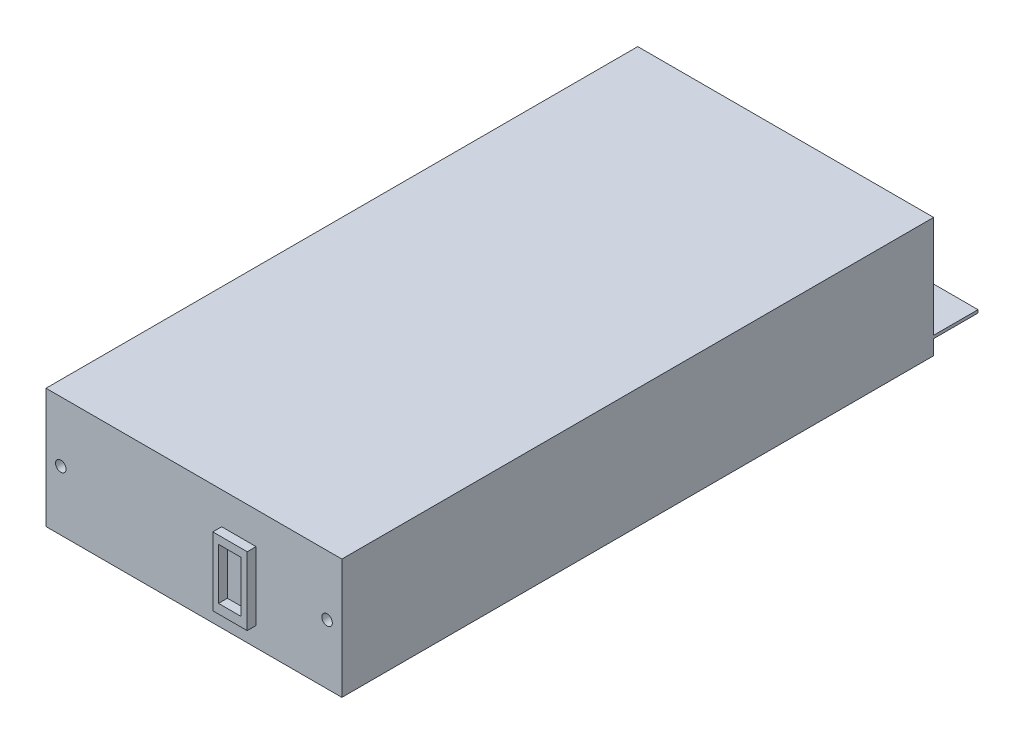
ISO-10303-21;
HEADER;
FILE_DESCRIPTION(('STEP AP214'),'2;1');
FILE_NAME('part.step','',(''),(''),'','','');
FILE_SCHEMA(('AUTOMOTIVE_DESIGN { 1 0 10303 214 1 1 1 1 }'));
ENDSEC;
DATA;
#1=APPLICATION_CONTEXT('core data for automotive mechanical design processes');
#2=APPLICATION_PROTOCOL_DEFINITION('international standard','automotive_design',2000,#1);
#3=PRODUCT_CONTEXT('',#1,'mechanical');
#4=PRODUCT('Part','Part','',(#3));
#5=PRODUCT_RELATED_PRODUCT_CATEGORY('part','',(#4));
#6=PRODUCT_DEFINITION_FORMATION('','',#4);
#7=PRODUCT_DEFINITION_CONTEXT('part definition',#1,'design');
#8=PRODUCT_DEFINITION('design','',#6,#7);
#9=PRODUCT_DEFINITION_SHAPE('','',#8);
#10=(LENGTH_UNIT() NAMED_UNIT(*) SI_UNIT(.MILLI.,.METRE.));
#11=(NAMED_UNIT(*) PLANE_ANGLE_UNIT() SI_UNIT($,.RADIAN.));
#12=(NAMED_UNIT(*) SI_UNIT($,.STERADIAN.) SOLID_ANGLE_UNIT());
#13=UNCERTAINTY_MEASURE_WITH_UNIT(LENGTH_MEASURE(1.E-05),#10,'distance_accuracy_value','');
#14=(GEOMETRIC_REPRESENTATION_CONTEXT(3) GLOBAL_UNCERTAINTY_ASSIGNED_CONTEXT((#13)) GLOBAL_UNIT_ASSIGNED_CONTEXT((#10,
#11,#12)) REPRESENTATION_CONTEXT('',''));
#15=CARTESIAN_POINT('',(0.,0.,0.));
#16=DIRECTION('',(0.,0.,1.));
#17=DIRECTION('',(1.,0.,0.));
#18=AXIS2_PLACEMENT_3D('',#15,#16,#17);
#19=CARTESIAN_POINT('',(0.,-40.5,200.));
#20=DIRECTION('',(0.,0.,1.));
#21=DIRECTION('',(1.,0.,0.));
#22=AXIS2_PLACEMENT_3D('',#19,#20,#21);
#23=PLANE('',#22);
#24=DIRECTION('',(0.,-1.,0.));
#25=VECTOR('',#24,1.);
#26=CARTESIAN_POINT('',(0.,0.,200.));
#27=LINE('',#26,#25);
#28=CARTESIAN_POINT('',(0.,0.,200.));
#29=VERTEX_POINT('',#28);
#30=CARTESIAN_POINT('',(0.,-40.5,200.));
#31=VERTEX_POINT('',#30);
#32=EDGE_CURVE('E320',#29,#31,#27,.T.);
#33=ORIENTED_EDGE('',*,*,#32,.T.);
#34=DIRECTION('',(1.,0.,0.));
#35=VECTOR('',#34,1.);
#36=CARTESIAN_POINT('',(0.,-40.5,200.));
#37=LINE('',#36,#35);
#38=CARTESIAN_POINT('',(100.,-40.5,200.));
#39=VERTEX_POINT('',#38);
#40=EDGE_CURVE('E330',#31,#39,#37,.T.);
#41=ORIENTED_EDGE('',*,*,#40,.T.);
#42=DIRECTION('',(0.,1.,0.));
#43=VECTOR('',#42,1.);
#44=CARTESIAN_POINT('',(100.,0.,200.));
#45=LINE('',#44,#43);
#46=CARTESIAN_POINT('',(100.,0.,200.));
#47=VERTEX_POINT('',#46);
#48=EDGE_CURVE('E316',#39,#47,#45,.T.);
#49=ORIENTED_EDGE('',*,*,#48,.T.);
#50=DIRECTION('',(-1.,0.,0.));
#51=VECTOR('',#50,1.);
#52=CARTESIAN_POINT('',(0.,0.,200.));
#53=LINE('',#52,#51);
#54=EDGE_CURVE('E333',#47,#29,#53,.T.);
#55=ORIENTED_EDGE('',*,*,#54,.T.);
#56=EDGE_LOOP('',(#33,#41,#49,#55));
#57=FACE_BOUND('',#56,.T.);
#58=CARTESIAN_POINT('',(95.,-20.3,200.));
#59=DIRECTION('',(0.,0.,1.));
#60=DIRECTION('',(1.,0.,0.));
#61=AXIS2_PLACEMENT_3D('',#58,#59,#60);
#62=CIRCLE('',#61,1.77800000000001);
#63=CARTESIAN_POINT('',(96.778,-20.3,200.));
#64=VERTEX_POINT('',#63);
#65=EDGE_CURVE('E346',#64,#64,#62,.T.);
#66=ORIENTED_EDGE('',*,*,#65,.F.);
#67=EDGE_LOOP('',(#66));
#68=FACE_BOUND('',#67,.T.);
#69=CARTESIAN_POINT('',(5.,-20.3,200.));
#70=DIRECTION('',(0.,0.,1.));
#71=DIRECTION('',(1.,0.,0.));
#72=AXIS2_PLACEMENT_3D('',#69,#70,#71);
#73=CIRCLE('',#72,1.778);
#74=CARTESIAN_POINT('',(6.778,-20.3,200.));
#75=VERTEX_POINT('',#74);
#76=EDGE_CURVE('E236',#75,#75,#73,.T.);
#77=ORIENTED_EDGE('',*,*,#76,.F.);
#78=EDGE_LOOP('',(#77));
#79=FACE_BOUND('',#78,.T.);
#80=DIRECTION('',(-1.,0.,0.));
#81=VECTOR('',#80,1.);
#82=CARTESIAN_POINT('',(71.0034523524499,-10.8555319811217,200.));
#83=LINE('',#82,#81);
#84=CARTESIAN_POINT('',(71.0034523524499,-10.8555319811217,200.));
#85=VERTEX_POINT('',#84);
#86=CARTESIAN_POINT('',(59.3741551003717,-10.8555319811217,200.));
#87=VERTEX_POINT('',#86);
#88=EDGE_CURVE('E183',#85,#87,#83,.T.);
#89=ORIENTED_EDGE('',*,*,#88,.F.);
#90=DIRECTION('',(0.,1.,0.));
#91=VECTOR('',#90,1.);
#92=CARTESIAN_POINT('',(71.0034523524499,-10.8555319811217,200.));
#93=LINE('',#92,#91);
#94=CARTESIAN_POINT('',(71.0034523524499,-33.9529620823669,200.));
#95=VERTEX_POINT('',#94);
#96=EDGE_CURVE('E178',#95,#85,#93,.T.);
#97=ORIENTED_EDGE('',*,*,#96,.F.);
#98=DIRECTION('',(1.,0.,0.));
#99=VECTOR('',#98,1.);
#100=CARTESIAN_POINT('',(71.0034523524499,-33.9529620823669,200.));
#101=LINE('',#100,#99);
#102=CARTESIAN_POINT('',(59.3741551003717,-33.9529620823669,200.));
#103=VERTEX_POINT('',#102);
#104=EDGE_CURVE('E187',#103,#95,#101,.T.);
#105=ORIENTED_EDGE('',*,*,#104,.F.);
#106=DIRECTION('',(0.,-1.,0.));
#107=VECTOR('',#106,1.);
#108=CARTESIAN_POINT('',(59.3741551003717,-10.8555319811217,200.));
#109=LINE('',#108,#107);
#110=EDGE_CURVE('E185',#87,#103,#109,.T.);
#111=ORIENTED_EDGE('',*,*,#110,.F.);
#112=EDGE_LOOP('',(#89,#97,#105,#111));
#113=FACE_BOUND('',#112,.T.);
#114=ADVANCED_FACE('F24',(#57,#68,#79,#113),#23,.T.);
#115=CARTESIAN_POINT('',(0.,-40.5,0.));
#116=DIRECTION('',(0.,0.,1.));
#117=DIRECTION('',(1.,0.,0.));
#118=AXIS2_PLACEMENT_3D('',#115,#116,#117);
#119=PLANE('',#118);
#120=DIRECTION('',(-1.,0.,0.));
#121=VECTOR('',#120,1.);
#122=CARTESIAN_POINT('',(0.,-35.5,0.));
#123=LINE('',#122,#121);
#124=CARTESIAN_POINT('',(100.,-35.5,0.));
#125=VERTEX_POINT('',#124);
#126=CARTESIAN_POINT('',(0.,-35.5,0.));
#127=VERTEX_POINT('',#126);
#128=EDGE_CURVE('E223',#125,#127,#123,.T.);
#129=ORIENTED_EDGE('',*,*,#128,.F.);
#130=DIRECTION('',(0.,1.,0.));
#131=VECTOR('',#130,1.);
#132=CARTESIAN_POINT('',(100.,0.,0.));
#133=LINE('',#132,#131);
#134=CARTESIAN_POINT('',(100.,-40.5,0.));
#135=VERTEX_POINT('',#134);
#136=EDGE_CURVE('E314',#135,#125,#133,.T.);
#137=ORIENTED_EDGE('',*,*,#136,.F.);
#138=DIRECTION('',(1.,0.,0.));
#139=VECTOR('',#138,1.);
#140=CARTESIAN_POINT('',(0.,-40.5,0.));
#141=LINE('',#140,#139);
#142=CARTESIAN_POINT('',(0.,-40.5,0.));
#143=VERTEX_POINT('',#142);
#144=EDGE_CURVE('E305',#143,#135,#141,.T.);
#145=ORIENTED_EDGE('',*,*,#144,.F.);
#146=DIRECTION('',(0.,-1.,0.));
#147=VECTOR('',#146,1.);
#148=CARTESIAN_POINT('',(0.,0.,0.));
#149=LINE('',#148,#147);
#150=EDGE_CURVE('E323',#127,#143,#149,.T.);
#151=ORIENTED_EDGE('',*,*,#150,.F.);
#152=EDGE_LOOP('',(#129,#137,#145,#151));
#153=FACE_BOUND('',#152,.T.);
#154=ADVANCED_FACE('F274',(#153),#119,.F.);
#155=DIRECTION('',(1.,0.,0.));
#156=VECTOR('',#155,1.);
#157=CARTESIAN_POINT('',(0.,-34.5,0.));
#158=LINE('',#157,#156);
#159=CARTESIAN_POINT('',(0.,-34.5,0.));
#160=VERTEX_POINT('',#159);
#161=CARTESIAN_POINT('',(100.,-34.5,0.));
#162=VERTEX_POINT('',#161);
#163=EDGE_CURVE('E219',#160,#162,#158,.T.);
#164=ORIENTED_EDGE('',*,*,#163,.F.);
#165=CARTESIAN_POINT('',(0.,0.,0.));
#166=VERTEX_POINT('',#165);
#167=EDGE_CURVE('E310',#166,#160,#149,.T.);
#168=ORIENTED_EDGE('',*,*,#167,.F.);
#169=DIRECTION('',(-1.,0.,0.));
#170=VECTOR('',#169,1.);
#171=CARTESIAN_POINT('',(0.,0.,0.));
#172=LINE('',#171,#170);
#173=CARTESIAN_POINT('',(100.,0.,0.));
#174=VERTEX_POINT('',#173);
#175=EDGE_CURVE('E319',#174,#166,#172,.T.);
#176=ORIENTED_EDGE('',*,*,#175,.F.);
#177=EDGE_CURVE('E224',#162,#174,#133,.T.);
#178=ORIENTED_EDGE('',*,*,#177,.F.);
#179=EDGE_LOOP('',(#164,#168,#176,#178));
#180=FACE_BOUND('',#179,.T.);
#181=ADVANCED_FACE('F281',(#180),#119,.F.);
#182=CARTESIAN_POINT('',(0.,0.,200.));
#183=DIRECTION('',(1.,0.,0.));
#184=DIRECTION('',(0.,1.,0.));
#185=AXIS2_PLACEMENT_3D('',#182,#183,#184);
#186=PLANE('',#185);
#187=ORIENTED_EDGE('',*,*,#167,.T.);
#188=DIRECTION('',(0.,0.,1.));
#189=VECTOR('',#188,1.);
#190=CARTESIAN_POINT('',(0.,-34.5,-15.));
#191=LINE('',#190,#189);
#192=CARTESIAN_POINT('',(0.,-34.5,-15.));
#193=VERTEX_POINT('',#192);
#194=EDGE_CURVE('E230',#193,#160,#191,.T.);
#195=ORIENTED_EDGE('',*,*,#194,.F.);
#196=DIRECTION('',(0.,1.,0.));
#197=VECTOR('',#196,1.);
#198=CARTESIAN_POINT('',(0.,-35.5,-15.));
#199=LINE('',#198,#197);
#200=CARTESIAN_POINT('',(0.,-35.5,-15.));
#201=VERTEX_POINT('',#200);
#202=EDGE_CURVE('E241',#201,#193,#199,.T.);
#203=ORIENTED_EDGE('',*,*,#202,.F.);
#204=DIRECTION('',(0.,0.,1.));
#205=VECTOR('',#204,1.);
#206=CARTESIAN_POINT('',(0.,-35.5,-15.));
#207=LINE('',#206,#205);
#208=EDGE_CURVE('E242',#201,#127,#207,.T.);
#209=ORIENTED_EDGE('',*,*,#208,.T.);
#210=ORIENTED_EDGE('',*,*,#150,.T.);
#211=DIRECTION('',(0.,0.,-1.));
#212=VECTOR('',#211,1.);
#213=CARTESIAN_POINT('',(0.,-40.5,200.));
#214=LINE('',#213,#212);
#215=EDGE_CURVE('E11',#31,#143,#214,.T.);
#216=ORIENTED_EDGE('',*,*,#215,.F.);
#217=ORIENTED_EDGE('',*,*,#32,.F.);
#218=DIRECTION('',(0.,0.,-1.));
#219=VECTOR('',#218,1.);
#220=CARTESIAN_POINT('',(0.,0.,200.));
#221=LINE('',#220,#219);
#222=EDGE_CURVE('E335',#29,#166,#221,.T.);
#223=ORIENTED_EDGE('',*,*,#222,.T.);
#224=EDGE_LOOP('',(#187,#195,#203,#209,#210,#216,#217,#223));
#225=FACE_BOUND('',#224,.T.);
#226=ADVANCED_FACE('F26',(#225),#186,.F.);
#227=CARTESIAN_POINT('',(0.,-40.5,200.));
#228=DIRECTION('',(0.,1.,0.));
#229=DIRECTION('',(0.,0.,1.));
#230=AXIS2_PLACEMENT_3D('',#227,#228,#229);
#231=PLANE('',#230);
#232=ORIENTED_EDGE('',*,*,#144,.T.);
#233=DIRECTION('',(0.,0.,-1.));
#234=VECTOR('',#233,1.);
#235=CARTESIAN_POINT('',(100.,-40.5,200.));
#236=LINE('',#235,#234);
#237=EDGE_CURVE('E33',#39,#135,#236,.T.);
#238=ORIENTED_EDGE('',*,*,#237,.F.);
#239=ORIENTED_EDGE('',*,*,#40,.F.);
#240=ORIENTED_EDGE('',*,*,#215,.T.);
#241=EDGE_LOOP('',(#232,#238,#239,#240));
#242=FACE_BOUND('',#241,.T.);
#243=ADVANCED_FACE('F295',(#242),#231,.F.);
#244=CARTESIAN_POINT('',(100.,0.,200.));
#245=DIRECTION('',(-1.,0.,0.));
#246=DIRECTION('',(0.,0.,1.));
#247=AXIS2_PLACEMENT_3D('',#244,#245,#246);
#248=PLANE('',#247);
#249=ORIENTED_EDGE('',*,*,#136,.T.);
#250=DIRECTION('',(0.,0.,1.));
#251=VECTOR('',#250,1.);
#252=CARTESIAN_POINT('',(100.,-35.5,-15.));
#253=LINE('',#252,#251);
#254=CARTESIAN_POINT('',(100.,-35.5,-15.));
#255=VERTEX_POINT('',#254);
#256=EDGE_CURVE('E231',#255,#125,#253,.T.);
#257=ORIENTED_EDGE('',*,*,#256,.F.);
#258=DIRECTION('',(0.,-1.,0.));
#259=VECTOR('',#258,1.);
#260=CARTESIAN_POINT('',(100.,-35.5,-15.));
#261=LINE('',#260,#259);
#262=CARTESIAN_POINT('',(100.,-34.5,-15.));
#263=VERTEX_POINT('',#262);
#264=EDGE_CURVE('E355',#263,#255,#261,.T.);
#265=ORIENTED_EDGE('',*,*,#264,.F.);
#266=DIRECTION('',(0.,0.,1.));
#267=VECTOR('',#266,1.);
#268=CARTESIAN_POINT('',(100.,-34.5,-15.));
#269=LINE('',#268,#267);
#270=EDGE_CURVE('E227',#263,#162,#269,.T.);
#271=ORIENTED_EDGE('',*,*,#270,.T.);
#272=ORIENTED_EDGE('',*,*,#177,.T.);
#273=DIRECTION('',(0.,0.,-1.));
#274=VECTOR('',#273,1.);
#275=CARTESIAN_POINT('',(100.,0.,200.));
#276=LINE('',#275,#274);
#277=EDGE_CURVE('E317',#47,#174,#276,.T.);
#278=ORIENTED_EDGE('',*,*,#277,.F.);
#279=ORIENTED_EDGE('',*,*,#48,.F.);
#280=ORIENTED_EDGE('',*,*,#237,.T.);
#281=EDGE_LOOP('',(#249,#257,#265,#271,#272,#278,#279,#280));
#282=FACE_BOUND('',#281,.T.);
#283=ADVANCED_FACE('F292',(#282),#248,.F.);
#284=CARTESIAN_POINT('',(0.,0.,200.));
#285=DIRECTION('',(0.,-1.,0.));
#286=DIRECTION('',(0.,0.,-1.));
#287=AXIS2_PLACEMENT_3D('',#284,#285,#286);
#288=PLANE('',#287);
#289=ORIENTED_EDGE('',*,*,#175,.T.);
#290=ORIENTED_EDGE('',*,*,#222,.F.);
#291=ORIENTED_EDGE('',*,*,#54,.F.);
#292=ORIENTED_EDGE('',*,*,#277,.T.);
#293=EDGE_LOOP('',(#289,#290,#291,#292));
#294=FACE_BOUND('',#293,.T.);
#295=ADVANCED_FACE('F288',(#294),#288,.F.);
#296=CARTESIAN_POINT('',(95.,-20.3,190.));
#297=DIRECTION('',(0.,0.,1.));
#298=DIRECTION('',(1.,0.,0.));
#299=AXIS2_PLACEMENT_3D('',#296,#297,#298);
#300=CYLINDRICAL_SURFACE('',#299,1.77800000000001);
#301=CARTESIAN_POINT('',(95.,-20.3,190.));
#302=DIRECTION('',(0.,0.,1.));
#303=DIRECTION('',(1.,0.,0.));
#304=AXIS2_PLACEMENT_3D('',#301,#302,#303);
#305=CIRCLE('',#304,1.77800000000001);
#306=CARTESIAN_POINT('',(96.778,-20.3,190.));
#307=VERTEX_POINT('',#306);
#308=EDGE_CURVE('E342',#307,#307,#305,.T.);
#309=ORIENTED_EDGE('',*,*,#308,.F.);
#310=EDGE_LOOP('',(#309));
#311=FACE_BOUND('',#310,.T.);
#312=ORIENTED_EDGE('',*,*,#65,.T.);
#313=EDGE_LOOP('',(#312));
#314=FACE_BOUND('',#313,.T.);
#315=ADVANCED_FACE('F291',(#311,#314),#300,.F.);
#316=CARTESIAN_POINT('',(95.,-20.3,190.));
#317=DIRECTION('',(0.,0.,1.));
#318=DIRECTION('',(1.,0.,0.));
#319=AXIS2_PLACEMENT_3D('',#316,#317,#318);
#320=PLANE('',#319);
#321=ORIENTED_EDGE('',*,*,#308,.T.);
#322=EDGE_LOOP('',(#321));
#323=FACE_BOUND('',#322,.T.);
#324=ADVANCED_FACE('F417',(#323),#320,.T.);
#325=CARTESIAN_POINT('',(5.,-20.3,190.));
#326=DIRECTION('',(0.,0.,1.));
#327=DIRECTION('',(1.,0.,0.));
#328=AXIS2_PLACEMENT_3D('',#325,#326,#327);
#329=CYLINDRICAL_SURFACE('',#328,1.778);
#330=CARTESIAN_POINT('',(5.,-20.3,190.));
#331=DIRECTION('',(0.,0.,1.));
#332=DIRECTION('',(1.,0.,0.));
#333=AXIS2_PLACEMENT_3D('',#330,#331,#332);
#334=CIRCLE('',#333,1.778);
#335=CARTESIAN_POINT('',(6.778,-20.3,190.));
#336=VERTEX_POINT('',#335);
#337=EDGE_CURVE('E349',#336,#336,#334,.T.);
#338=ORIENTED_EDGE('',*,*,#337,.F.);
#339=EDGE_LOOP('',(#338));
#340=FACE_BOUND('',#339,.T.);
#341=ORIENTED_EDGE('',*,*,#76,.T.);
#342=EDGE_LOOP('',(#341));
#343=FACE_BOUND('',#342,.T.);
#344=ADVANCED_FACE('F413',(#340,#343),#329,.F.);
#345=CARTESIAN_POINT('',(5.,-20.3,190.));
#346=DIRECTION('',(0.,0.,1.));
#347=DIRECTION('',(1.,0.,0.));
#348=AXIS2_PLACEMENT_3D('',#345,#346,#347);
#349=PLANE('',#348);
#350=ORIENTED_EDGE('',*,*,#337,.T.);
#351=EDGE_LOOP('',(#350));
#352=FACE_BOUND('',#351,.T.);
#353=ADVANCED_FACE('F400',(#352),#349,.T.);
#354=CARTESIAN_POINT('',(0.,-34.5,-15.));
#355=DIRECTION('',(0.,-1.,0.));
#356=DIRECTION('',(1.,0.,0.));
#357=AXIS2_PLACEMENT_3D('',#354,#355,#356);
#358=PLANE('',#357);
#359=CARTESIAN_POINT('',(85.,-34.5,-10.9999999999999));
#360=DIRECTION('',(0.,1.,0.));
#361=DIRECTION('',(-1.,0.,0.));
#362=AXIS2_PLACEMENT_3D('',#359,#360,#361);
#363=CIRCLE('',#362,1.77800000000001);
#364=CARTESIAN_POINT('',(83.222,-34.5,-10.9999999999999));
#365=VERTEX_POINT('',#364);
#366=EDGE_CURVE('E207',#365,#365,#363,.T.);
#367=ORIENTED_EDGE('',*,*,#366,.F.);
#368=EDGE_LOOP('',(#367));
#369=FACE_BOUND('',#368,.T.);
#370=CARTESIAN_POINT('',(15.,-34.5,-11.));
#371=DIRECTION('',(0.,1.,0.));
#372=DIRECTION('',(-1.,0.,0.));
#373=AXIS2_PLACEMENT_3D('',#370,#371,#372);
#374=CIRCLE('',#373,1.77800000000001);
#375=CARTESIAN_POINT('',(13.222,-34.5,-11.));
#376=VERTEX_POINT('',#375);
#377=EDGE_CURVE('E210',#376,#376,#374,.T.);
#378=ORIENTED_EDGE('',*,*,#377,.F.);
#379=EDGE_LOOP('',(#378));
#380=FACE_BOUND('',#379,.T.);
#381=ORIENTED_EDGE('',*,*,#163,.T.);
#382=ORIENTED_EDGE('',*,*,#270,.F.);
#383=DIRECTION('',(1.,0.,0.));
#384=VECTOR('',#383,1.);
#385=CARTESIAN_POINT('',(0.,-34.5,-15.));
#386=LINE('',#385,#384);
#387=EDGE_CURVE('E357',#193,#263,#386,.T.);
#388=ORIENTED_EDGE('',*,*,#387,.F.);
#389=ORIENTED_EDGE('',*,*,#194,.T.);
#390=EDGE_LOOP('',(#381,#382,#388,#389));
#391=FACE_BOUND('',#390,.T.);
#392=ADVANCED_FACE('F366',(#369,#380,#391),#358,.F.);
#393=CARTESIAN_POINT('',(0.,-35.5,-15.));
#394=DIRECTION('',(0.,1.,0.));
#395=DIRECTION('',(-1.,0.,0.));
#396=AXIS2_PLACEMENT_3D('',#393,#394,#395);
#397=PLANE('',#396);
#398=CARTESIAN_POINT('',(85.,-35.5,-10.9999999999999));
#399=DIRECTION('',(0.,1.,0.));
#400=DIRECTION('',(-1.,0.,0.));
#401=AXIS2_PLACEMENT_3D('',#398,#399,#400);
#402=CIRCLE('',#401,1.77800000000001);
#403=CARTESIAN_POINT('',(83.222,-35.5,-10.9999999999999));
#404=VERTEX_POINT('',#403);
#405=EDGE_CURVE('E28',#404,#404,#402,.T.);
#406=ORIENTED_EDGE('',*,*,#405,.T.);
#407=EDGE_LOOP('',(#406));
#408=FACE_BOUND('',#407,.T.);
#409=CARTESIAN_POINT('',(15.,-35.5,-11.));
#410=DIRECTION('',(0.,1.,0.));
#411=DIRECTION('',(-1.,0.,0.));
#412=AXIS2_PLACEMENT_3D('',#409,#410,#411);
#413=CIRCLE('',#412,1.77800000000001);
#414=CARTESIAN_POINT('',(13.222,-35.5,-11.));
#415=VERTEX_POINT('',#414);
#416=EDGE_CURVE('E213',#415,#415,#413,.T.);
#417=ORIENTED_EDGE('',*,*,#416,.T.);
#418=EDGE_LOOP('',(#417));
#419=FACE_BOUND('',#418,.T.);
#420=ORIENTED_EDGE('',*,*,#128,.T.);
#421=ORIENTED_EDGE('',*,*,#208,.F.);
#422=DIRECTION('',(-1.,0.,0.));
#423=VECTOR('',#422,1.);
#424=CARTESIAN_POINT('',(0.,-35.5,-15.));
#425=LINE('',#424,#423);
#426=EDGE_CURVE('E245',#255,#201,#425,.T.);
#427=ORIENTED_EDGE('',*,*,#426,.F.);
#428=ORIENTED_EDGE('',*,*,#256,.T.);
#429=EDGE_LOOP('',(#420,#421,#427,#428));
#430=FACE_BOUND('',#429,.T.);
#431=ADVANCED_FACE('F254',(#408,#419,#430),#397,.F.);
#432=CARTESIAN_POINT('',(0.,-34.5,-15.));
#433=DIRECTION('',(0.,0.,-1.));
#434=DIRECTION('',(-1.,0.,0.));
#435=AXIS2_PLACEMENT_3D('',#432,#433,#434);
#436=PLANE('',#435);
#437=ORIENTED_EDGE('',*,*,#202,.T.);
#438=ORIENTED_EDGE('',*,*,#387,.T.);
#439=ORIENTED_EDGE('',*,*,#264,.T.);
#440=ORIENTED_EDGE('',*,*,#426,.T.);
#441=EDGE_LOOP('',(#437,#438,#439,#440));
#442=FACE_BOUND('',#441,.T.);
#443=ADVANCED_FACE('F260',(#442),#436,.T.);
#444=CARTESIAN_POINT('',(15.,-49.5,-11.));
#445=DIRECTION('',(0.,1.,0.));
#446=DIRECTION('',(-1.,0.,0.));
#447=AXIS2_PLACEMENT_3D('',#444,#445,#446);
#448=CYLINDRICAL_SURFACE('',#447,1.77800000000001);
#449=ORIENTED_EDGE('',*,*,#377,.T.);
#450=EDGE_LOOP('',(#449));
#451=FACE_BOUND('',#450,.T.);
#452=ORIENTED_EDGE('',*,*,#416,.F.);
#453=EDGE_LOOP('',(#452));
#454=FACE_BOUND('',#453,.T.);
#455=ADVANCED_FACE('F257',(#451,#454),#448,.F.);
#456=CARTESIAN_POINT('',(85.,-49.5,-10.9999999999999));
#457=DIRECTION('',(0.,1.,0.));
#458=DIRECTION('',(-1.,0.,0.));
#459=AXIS2_PLACEMENT_3D('',#456,#457,#458);
#460=CYLINDRICAL_SURFACE('',#459,1.77800000000001);
#461=ORIENTED_EDGE('',*,*,#366,.T.);
#462=EDGE_LOOP('',(#461));
#463=FACE_BOUND('',#462,.T.);
#464=ORIENTED_EDGE('',*,*,#405,.F.);
#465=EDGE_LOOP('',(#464));
#466=FACE_BOUND('',#465,.T.);
#467=ADVANCED_FACE('F259',(#463,#466),#460,.F.);
#468=CARTESIAN_POINT('',(71.0034523524499,-10.8555319811217,203.));
#469=DIRECTION('',(-1.,0.,0.));
#470=DIRECTION('',(0.,0.,1.));
#471=AXIS2_PLACEMENT_3D('',#468,#469,#470);
#472=PLANE('',#471);
#473=ORIENTED_EDGE('',*,*,#96,.T.);
#474=DIRECTION('',(0.,0.,-1.));
#475=VECTOR('',#474,1.);
#476=CARTESIAN_POINT('',(71.0034523524499,-10.8555319811217,203.));
#477=LINE('',#476,#475);
#478=CARTESIAN_POINT('',(71.0034523524499,-10.8555319811217,203.));
#479=VERTEX_POINT('',#478);
#480=EDGE_CURVE('E205',#479,#85,#477,.T.);
#481=ORIENTED_EDGE('',*,*,#480,.F.);
#482=DIRECTION('',(0.,1.,0.));
#483=VECTOR('',#482,1.);
#484=CARTESIAN_POINT('',(71.0034523524499,-10.8555319811217,203.));
#485=LINE('',#484,#483);
#486=CARTESIAN_POINT('',(71.0034523524499,-33.9529620823669,203.));
#487=VERTEX_POINT('',#486);
#488=EDGE_CURVE('E189',#487,#479,#485,.T.);
#489=ORIENTED_EDGE('',*,*,#488,.F.);
#490=DIRECTION('',(0.,0.,-1.));
#491=VECTOR('',#490,1.);
#492=CARTESIAN_POINT('',(71.0034523524499,-33.9529620823669,203.));
#493=LINE('',#492,#491);
#494=EDGE_CURVE('E198',#487,#95,#493,.T.);
#495=ORIENTED_EDGE('',*,*,#494,.T.);
#496=EDGE_LOOP('',(#473,#481,#489,#495));
#497=FACE_BOUND('',#496,.T.);
#498=ADVANCED_FACE('F267',(#497),#472,.F.);
#499=CARTESIAN_POINT('',(71.0034523524499,-10.8555319811217,203.));
#500=DIRECTION('',(0.,-1.,0.));
#501=DIRECTION('',(0.,0.,-1.));
#502=AXIS2_PLACEMENT_3D('',#499,#500,#501);
#503=PLANE('',#502);
#504=ORIENTED_EDGE('',*,*,#88,.T.);
#505=DIRECTION('',(0.,0.,-1.));
#506=VECTOR('',#505,1.);
#507=CARTESIAN_POINT('',(59.3741551003717,-10.8555319811217,203.));
#508=LINE('',#507,#506);
#509=CARTESIAN_POINT('',(59.3741551003717,-10.8555319811217,203.));
#510=VERTEX_POINT('',#509);
#511=EDGE_CURVE('E202',#510,#87,#508,.T.);
#512=ORIENTED_EDGE('',*,*,#511,.F.);
#513=DIRECTION('',(-1.,0.,0.));
#514=VECTOR('',#513,1.);
#515=CARTESIAN_POINT('',(71.0034523524499,-10.8555319811217,203.));
#516=LINE('',#515,#514);
#517=EDGE_CURVE('E192',#479,#510,#516,.T.);
#518=ORIENTED_EDGE('',*,*,#517,.F.);
#519=ORIENTED_EDGE('',*,*,#480,.T.);
#520=EDGE_LOOP('',(#504,#512,#518,#519));
#521=FACE_BOUND('',#520,.T.);
#522=ADVANCED_FACE('F437',(#521),#503,.F.);
#523=CARTESIAN_POINT('',(59.3741551003717,-10.8555319811217,203.));
#524=DIRECTION('',(1.,0.,0.));
#525=DIRECTION('',(0.,0.,-1.));
#526=AXIS2_PLACEMENT_3D('',#523,#524,#525);
#527=PLANE('',#526);
#528=ORIENTED_EDGE('',*,*,#110,.T.);
#529=DIRECTION('',(0.,0.,-1.));
#530=VECTOR('',#529,1.);
#531=CARTESIAN_POINT('',(59.3741551003717,-33.9529620823669,203.));
#532=LINE('',#531,#530);
#533=CARTESIAN_POINT('',(59.3741551003717,-33.9529620823669,203.));
#534=VERTEX_POINT('',#533);
#535=EDGE_CURVE('E49',#534,#103,#532,.T.);
#536=ORIENTED_EDGE('',*,*,#535,.F.);
#537=DIRECTION('',(0.,-1.,0.));
#538=VECTOR('',#537,1.);
#539=CARTESIAN_POINT('',(59.3741551003717,-10.8555319811217,203.));
#540=LINE('',#539,#538);
#541=EDGE_CURVE('E194',#510,#534,#540,.T.);
#542=ORIENTED_EDGE('',*,*,#541,.F.);
#543=ORIENTED_EDGE('',*,*,#511,.T.);
#544=EDGE_LOOP('',(#528,#536,#542,#543));
#545=FACE_BOUND('',#544,.T.);
#546=ADVANCED_FACE('F441',(#545),#527,.F.);
#547=CARTESIAN_POINT('',(71.0034523524499,-33.9529620823669,203.));
#548=DIRECTION('',(0.,1.,0.));
#549=DIRECTION('',(0.,0.,1.));
#550=AXIS2_PLACEMENT_3D('',#547,#548,#549);
#551=PLANE('',#550);
#552=ORIENTED_EDGE('',*,*,#104,.T.);
#553=ORIENTED_EDGE('',*,*,#494,.F.);
#554=DIRECTION('',(1.,0.,0.));
#555=VECTOR('',#554,1.);
#556=CARTESIAN_POINT('',(71.0034523524499,-33.9529620823669,203.));
#557=LINE('',#556,#555);
#558=EDGE_CURVE('E196',#534,#487,#557,.T.);
#559=ORIENTED_EDGE('',*,*,#558,.F.);
#560=ORIENTED_EDGE('',*,*,#535,.T.);
#561=EDGE_LOOP('',(#552,#553,#559,#560));
#562=FACE_BOUND('',#561,.T.);
#563=ADVANCED_FACE('F445',(#562),#551,.F.);
#564=CARTESIAN_POINT('',(71.0034523524499,-33.9529620823669,203.));
#565=DIRECTION('',(0.,0.,-1.));
#566=DIRECTION('',(-1.,0.,0.));
#567=AXIS2_PLACEMENT_3D('',#564,#565,#566);
#568=PLANE('',#567);
#569=DIRECTION('',(1.,0.,0.));
#570=VECTOR('',#569,1.);
#571=CARTESIAN_POINT('',(61.2994463276836,-30.8218304656729,203.));
#572=LINE('',#571,#570);
#573=CARTESIAN_POINT('',(61.2994463276836,-30.8218304656729,203.));
#574=VERTEX_POINT('',#573);
#575=CARTESIAN_POINT('',(68.9180124122582,-30.8218304656729,203.));
#576=VERTEX_POINT('',#575);
#577=EDGE_CURVE('E155',#574,#576,#572,.T.);
#578=ORIENTED_EDGE('',*,*,#577,.F.);
#579=DIRECTION('',(0.,-1.,0.));
#580=VECTOR('',#579,1.);
#581=CARTESIAN_POINT('',(61.2994463276836,-13.5302535096722,203.));
#582=LINE('',#581,#580);
#583=CARTESIAN_POINT('',(61.2994463276836,-13.5302535096722,203.));
#584=VERTEX_POINT('',#583);
#585=EDGE_CURVE('E41',#584,#574,#582,.T.);
#586=ORIENTED_EDGE('',*,*,#585,.F.);
#587=DIRECTION('',(-1.,0.,0.));
#588=VECTOR('',#587,1.);
#589=CARTESIAN_POINT('',(61.2994463276836,-13.5302535096722,203.));
#590=LINE('',#589,#588);
#591=CARTESIAN_POINT('',(68.9180124122582,-13.5302535096722,203.));
#592=VERTEX_POINT('',#591);
#593=EDGE_CURVE('E162',#592,#584,#590,.T.);
#594=ORIENTED_EDGE('',*,*,#593,.F.);
#595=DIRECTION('',(0.,1.,0.));
#596=VECTOR('',#595,1.);
#597=CARTESIAN_POINT('',(68.9180124122582,-13.5302535096722,203.));
#598=LINE('',#597,#596);
#599=EDGE_CURVE('E144',#576,#592,#598,.T.);
#600=ORIENTED_EDGE('',*,*,#599,.F.);
#601=EDGE_LOOP('',(#578,#586,#594,#600));
#602=FACE_BOUND('',#601,.T.);
#603=ORIENTED_EDGE('',*,*,#488,.T.);
#604=ORIENTED_EDGE('',*,*,#517,.T.);
#605=ORIENTED_EDGE('',*,*,#541,.T.);
#606=ORIENTED_EDGE('',*,*,#558,.T.);
#607=EDGE_LOOP('',(#603,#604,#605,#606));
#608=FACE_BOUND('',#607,.T.);
#609=ADVANCED_FACE('F159',(#602,#608),#568,.F.);
#610=CARTESIAN_POINT('',(61.2994463276836,-13.5302535096722,200.));
#611=DIRECTION('',(-1.,0.,0.));
#612=DIRECTION('',(0.,0.,1.));
#613=AXIS2_PLACEMENT_3D('',#610,#611,#612);
#614=PLANE('',#613);
#615=ORIENTED_EDGE('',*,*,#585,.T.);
#616=DIRECTION('',(0.,0.,1.));
#617=VECTOR('',#616,1.);
#618=CARTESIAN_POINT('',(61.2994463276836,-30.8218304656729,200.));
#619=LINE('',#618,#617);
#620=CARTESIAN_POINT('',(61.2994463276836,-30.8218304656729,200.));
#621=VERTEX_POINT('',#620);
#622=EDGE_CURVE('E152',#621,#574,#619,.T.);
#623=ORIENTED_EDGE('',*,*,#622,.F.);
#624=DIRECTION('',(0.,-1.,0.));
#625=VECTOR('',#624,1.);
#626=CARTESIAN_POINT('',(61.2994463276836,-13.5302535096722,200.));
#627=LINE('',#626,#625);
#628=CARTESIAN_POINT('',(61.2994463276836,-13.5302535096722,200.));
#629=VERTEX_POINT('',#628);
#630=EDGE_CURVE('E164',#629,#621,#627,.T.);
#631=ORIENTED_EDGE('',*,*,#630,.F.);
#632=DIRECTION('',(0.,0.,1.));
#633=VECTOR('',#632,1.);
#634=CARTESIAN_POINT('',(61.2994463276836,-13.5302535096722,200.));
#635=LINE('',#634,#633);
#636=EDGE_CURVE('E176',#629,#584,#635,.T.);
#637=ORIENTED_EDGE('',*,*,#636,.T.);
#638=EDGE_LOOP('',(#615,#623,#631,#637));
#639=FACE_BOUND('',#638,.T.);
#640=ADVANCED_FACE('F452',(#639),#614,.F.);
#641=CARTESIAN_POINT('',(61.2994463276836,-13.5302535096722,200.));
#642=DIRECTION('',(0.,1.,0.));
#643=DIRECTION('',(0.,0.,1.));
#644=AXIS2_PLACEMENT_3D('',#641,#642,#643);
#645=PLANE('',#644);
#646=ORIENTED_EDGE('',*,*,#593,.T.);
#647=ORIENTED_EDGE('',*,*,#636,.F.);
#648=DIRECTION('',(-1.,0.,0.));
#649=VECTOR('',#648,1.);
#650=CARTESIAN_POINT('',(61.2994463276836,-13.5302535096722,200.));
#651=LINE('',#650,#649);
#652=CARTESIAN_POINT('',(68.9180124122582,-13.5302535096722,200.));
#653=VERTEX_POINT('',#652);
#654=EDGE_CURVE('E173',#653,#629,#651,.T.);
#655=ORIENTED_EDGE('',*,*,#654,.F.);
#656=DIRECTION('',(0.,0.,1.));
#657=VECTOR('',#656,1.);
#658=CARTESIAN_POINT('',(68.9180124122582,-13.5302535096722,200.));
#659=LINE('',#658,#657);
#660=EDGE_CURVE('E151',#653,#592,#659,.T.);
#661=ORIENTED_EDGE('',*,*,#660,.T.);
#662=EDGE_LOOP('',(#646,#647,#655,#661));
#663=FACE_BOUND('',#662,.T.);
#664=ADVANCED_FACE('F482',(#663),#645,.F.);
#665=CARTESIAN_POINT('',(68.9180124122582,-13.5302535096722,200.));
#666=DIRECTION('',(1.,0.,0.));
#667=DIRECTION('',(0.,0.,-1.));
#668=AXIS2_PLACEMENT_3D('',#665,#666,#667);
#669=PLANE('',#668);
#670=ORIENTED_EDGE('',*,*,#599,.T.);
#671=ORIENTED_EDGE('',*,*,#660,.F.);
#672=DIRECTION('',(0.,1.,0.));
#673=VECTOR('',#672,1.);
#674=CARTESIAN_POINT('',(68.9180124122582,-13.5302535096722,200.));
#675=LINE('',#674,#673);
#676=CARTESIAN_POINT('',(68.9180124122582,-30.8218304656729,200.));
#677=VERTEX_POINT('',#676);
#678=EDGE_CURVE('E147',#677,#653,#675,.T.);
#679=ORIENTED_EDGE('',*,*,#678,.F.);
#680=DIRECTION('',(0.,0.,1.));
#681=VECTOR('',#680,1.);
#682=CARTESIAN_POINT('',(68.9180124122582,-30.8218304656729,200.));
#683=LINE('',#682,#681);
#684=EDGE_CURVE('E140',#677,#576,#683,.T.);
#685=ORIENTED_EDGE('',*,*,#684,.T.);
#686=EDGE_LOOP('',(#670,#671,#679,#685));
#687=FACE_BOUND('',#686,.T.);
#688=ADVANCED_FACE('F142',(#687),#669,.F.);
#689=CARTESIAN_POINT('',(61.2994463276836,-30.8218304656729,200.));
#690=DIRECTION('',(0.,-1.,0.));
#691=DIRECTION('',(0.,0.,-1.));
#692=AXIS2_PLACEMENT_3D('',#689,#690,#691);
#693=PLANE('',#692);
#694=ORIENTED_EDGE('',*,*,#577,.T.);
#695=ORIENTED_EDGE('',*,*,#684,.F.);
#696=DIRECTION('',(1.,0.,0.));
#697=VECTOR('',#696,1.);
#698=CARTESIAN_POINT('',(61.2994463276836,-30.8218304656729,200.));
#699=LINE('',#698,#697);
#700=EDGE_CURVE('E170',#621,#677,#699,.T.);
#701=ORIENTED_EDGE('',*,*,#700,.F.);
#702=ORIENTED_EDGE('',*,*,#622,.T.);
#703=EDGE_LOOP('',(#694,#695,#701,#702));
#704=FACE_BOUND('',#703,.T.);
#705=ADVANCED_FACE('F156',(#704),#693,.F.);
#706=CARTESIAN_POINT('',(61.2994463276836,-30.8218304656729,200.));
#707=DIRECTION('',(0.,0.,1.));
#708=DIRECTION('',(1.,0.,0.));
#709=AXIS2_PLACEMENT_3D('',#706,#707,#708);
#710=PLANE('',#709);
#711=ORIENTED_EDGE('',*,*,#630,.T.);
#712=ORIENTED_EDGE('',*,*,#700,.T.);
#713=ORIENTED_EDGE('',*,*,#678,.T.);
#714=ORIENTED_EDGE('',*,*,#654,.T.);
#715=EDGE_LOOP('',(#711,#712,#713,#714));
#716=FACE_BOUND('',#715,.T.);
#717=ADVANCED_FACE('F501',(#716),#710,.T.);
#718=CLOSED_SHELL('',(#114,#154,#181,#226,#243,#283,#295,#315,#324,#344,#353,#392,#431,#443,
#455,#467,#498,#522,#546,#563,#609,#640,#664,#688,#705,#717));
#719=MANIFOLD_SOLID_BREP('B2',#718);
#720=ADVANCED_BREP_SHAPE_REPRESENTATION('',(#18,#719),#14);
#721=SHAPE_DEFINITION_REPRESENTATION(#9,#720);
ENDSEC;
END-ISO-10303-21;
